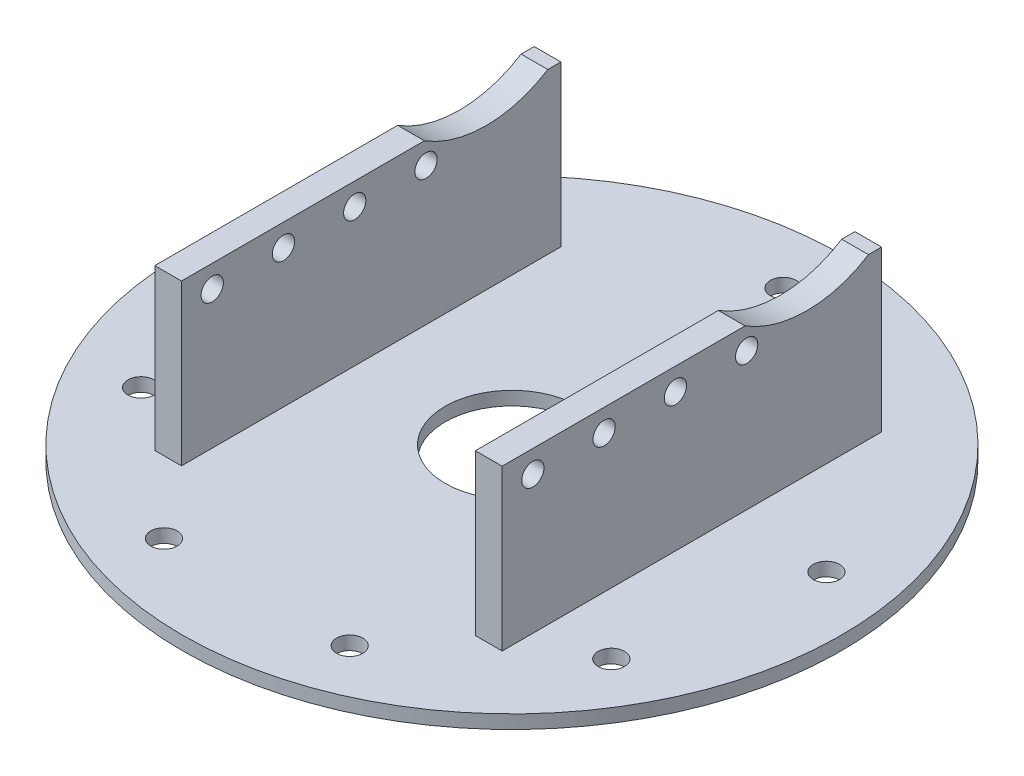
ISO-10303-21;
HEADER;
FILE_DESCRIPTION(('STEP AP214'),'2;1');
FILE_NAME('part.step','',(''),(''),'','','');
FILE_SCHEMA(('AUTOMOTIVE_DESIGN { 1 0 10303 214 1 1 1 1 }'));
ENDSEC;
DATA;
#1=APPLICATION_CONTEXT('core data for automotive mechanical design processes');
#2=APPLICATION_PROTOCOL_DEFINITION('international standard','automotive_design',2000,#1);
#3=PRODUCT_CONTEXT('',#1,'mechanical');
#4=PRODUCT('Part','Part','',(#3));
#5=PRODUCT_RELATED_PRODUCT_CATEGORY('part','',(#4));
#6=PRODUCT_DEFINITION_FORMATION('','',#4);
#7=PRODUCT_DEFINITION_CONTEXT('part definition',#1,'design');
#8=PRODUCT_DEFINITION('design','',#6,#7);
#9=PRODUCT_DEFINITION_SHAPE('','',#8);
#10=(LENGTH_UNIT() NAMED_UNIT(*) SI_UNIT(.MILLI.,.METRE.));
#11=(NAMED_UNIT(*) PLANE_ANGLE_UNIT() SI_UNIT($,.RADIAN.));
#12=(NAMED_UNIT(*) SI_UNIT($,.STERADIAN.) SOLID_ANGLE_UNIT());
#13=UNCERTAINTY_MEASURE_WITH_UNIT(LENGTH_MEASURE(1.E-05),#10,'distance_accuracy_value','');
#14=(GEOMETRIC_REPRESENTATION_CONTEXT(3) GLOBAL_UNCERTAINTY_ASSIGNED_CONTEXT((#13)) GLOBAL_UNIT_ASSIGNED_CONTEXT((#10,
#11,#12)) REPRESENTATION_CONTEXT('',''));
#15=CARTESIAN_POINT('',(0.,0.,0.));
#16=DIRECTION('',(0.,0.,1.));
#17=DIRECTION('',(1.,0.,0.));
#18=AXIS2_PLACEMENT_3D('',#15,#16,#17);
#19=CARTESIAN_POINT('',(26.1339066940855,19.4999999999999,-21.9999999999999));
#20=DIRECTION('',(0.,1.,0.));
#21=DIRECTION('',(0.,0.,1.));
#22=AXIS2_PLACEMENT_3D('',#19,#20,#21);
#23=PLANE('',#22);
#24=DIRECTION('',(-1.,0.,0.));
#25=VECTOR('',#24,1.);
#26=CARTESIAN_POINT('',(56.2695526217004,19.4999999999999,-20.5282032302754));
#27=LINE('',#26,#25);
#28=CARTESIAN_POINT('',(-16.4999999999999,19.4999999999999,-20.5282032302754));
#29=VERTEX_POINT('',#28);
#30=CARTESIAN_POINT('',(-19.4999999999999,19.4999999999999,-20.5282032302754));
#31=VERTEX_POINT('',#30);
#32=EDGE_CURVE('E119',#29,#31,#27,.T.);
#33=ORIENTED_EDGE('',*,*,#32,.F.);
#34=DIRECTION('',(0.,0.,1.));
#35=VECTOR('',#34,1.);
#36=CARTESIAN_POINT('',(-16.4999999999999,19.4999999999999,-21.9999999999999));
#37=LINE('',#36,#35);
#38=CARTESIAN_POINT('',(-16.4999999999999,19.4999999999999,-21.9999999999999));
#39=VERTEX_POINT('',#38);
#40=EDGE_CURVE('E151',#39,#29,#37,.T.);
#41=ORIENTED_EDGE('',*,*,#40,.F.);
#42=DIRECTION('',(-1.,0.,0.));
#43=VECTOR('',#42,1.);
#44=CARTESIAN_POINT('',(26.1339066940855,19.4999999999999,-21.9999999999999));
#45=LINE('',#44,#43);
#46=CARTESIAN_POINT('',(-19.4999999999999,19.4999999999999,-21.9999999999999));
#47=VERTEX_POINT('',#46);
#48=EDGE_CURVE('E142',#39,#47,#45,.T.);
#49=ORIENTED_EDGE('',*,*,#48,.T.);
#50=DIRECTION('',(0.,0.,-1.));
#51=VECTOR('',#50,1.);
#52=CARTESIAN_POINT('',(-19.4999999999999,19.4999999999999,-21.9999999999999));
#53=LINE('',#52,#51);
#54=EDGE_CURVE('E133',#31,#47,#53,.T.);
#55=ORIENTED_EDGE('',*,*,#54,.F.);
#56=EDGE_LOOP('',(#33,#41,#49,#55));
#57=FACE_BOUND('',#56,.T.);
#58=ADVANCED_FACE('F33',(#57),#23,.T.);
#59=CARTESIAN_POINT('',(-26.1339066940853,19.4999999999999,20.5999999999999));
#60=DIRECTION('',(0.,1.,0.));
#61=DIRECTION('',(0.,0.,1.));
#62=AXIS2_PLACEMENT_3D('',#59,#60,#61);
#63=PLANE('',#62);
#64=DIRECTION('',(-1.,0.,0.));
#65=VECTOR('',#64,1.);
#66=CARTESIAN_POINT('',(56.2695526217004,19.4999999999999,-20.5282032302754));
#67=LINE('',#66,#65);
#68=CARTESIAN_POINT('',(19.4999999999999,19.4999999999999,-20.5282032302754));
#69=VERTEX_POINT('',#68);
#70=CARTESIAN_POINT('',(16.5000000000001,19.4999999999999,-20.5282032302754));
#71=VERTEX_POINT('',#70);
#72=EDGE_CURVE('E11',#69,#71,#67,.T.);
#73=ORIENTED_EDGE('',*,*,#72,.F.);
#74=DIRECTION('',(0.,0.,1.));
#75=VECTOR('',#74,1.);
#76=CARTESIAN_POINT('',(19.4999999999999,19.4999999999999,20.5999999999999));
#77=LINE('',#76,#75);
#78=CARTESIAN_POINT('',(19.4999999999999,19.4999999999999,-21.9999999999999));
#79=VERTEX_POINT('',#78);
#80=EDGE_CURVE('E262',#79,#69,#77,.T.);
#81=ORIENTED_EDGE('',*,*,#80,.F.);
#82=DIRECTION('',(1.,0.,0.));
#83=VECTOR('',#82,1.);
#84=CARTESIAN_POINT('',(-26.1339066940853,19.4999999999999,-21.9999999999999));
#85=LINE('',#84,#83);
#86=CARTESIAN_POINT('',(16.5000000000001,19.4999999999999,-21.9999999999999));
#87=VERTEX_POINT('',#86);
#88=EDGE_CURVE('E269',#87,#79,#85,.T.);
#89=ORIENTED_EDGE('',*,*,#88,.F.);
#90=DIRECTION('',(0.,0.,-1.));
#91=VECTOR('',#90,1.);
#92=CARTESIAN_POINT('',(16.5000000000001,19.4999999999999,20.5999999999999));
#93=LINE('',#92,#91);
#94=EDGE_CURVE('E147',#71,#87,#93,.T.);
#95=ORIENTED_EDGE('',*,*,#94,.F.);
#96=EDGE_LOOP('',(#73,#81,#89,#95));
#97=FACE_BOUND('',#96,.T.);
#98=ADVANCED_FACE('F278',(#97),#63,.T.);
#99=CARTESIAN_POINT('',(0.,1.524,0.));
#100=DIRECTION('',(0.,1.,0.));
#101=DIRECTION('',(0.,0.,1.));
#102=AXIS2_PLACEMENT_3D('',#99,#100,#101);
#103=PLANE('',#102);
#104=CARTESIAN_POINT('',(0.,1.524,-30.48));
#105=DIRECTION('',(0.,1.,0.));
#106=DIRECTION('',(0.,0.,1.));
#107=AXIS2_PLACEMENT_3D('',#104,#105,#106);
#108=CIRCLE('',#107,1.47828000000001);
#109=CARTESIAN_POINT('',(0.,1.524,-29.00172));
#110=VERTEX_POINT('',#109);
#111=EDGE_CURVE('E192',#110,#110,#108,.T.);
#112=ORIENTED_EDGE('',*,*,#111,.F.);
#113=EDGE_LOOP('',(#112));
#114=FACE_BOUND('',#113,.T.);
#115=CARTESIAN_POINT('',(30.016940311812,1.524,-5.29279645528849));
#116=DIRECTION('',(0.,1.,0.));
#117=DIRECTION('',(0.,0.,1.));
#118=AXIS2_PLACEMENT_3D('',#115,#116,#117);
#119=CIRCLE('',#118,1.47828000000001);
#120=CARTESIAN_POINT('',(30.016940311812,1.524,-3.81451645528848));
#121=VERTEX_POINT('',#120);
#122=EDGE_CURVE('E198',#121,#121,#119,.T.);
#123=ORIENTED_EDGE('',*,*,#122,.F.);
#124=EDGE_LOOP('',(#123));
#125=FACE_BOUND('',#124,.T.);
#126=CARTESIAN_POINT('',(26.3964543073499,1.524,15.2399999999997));
#127=DIRECTION('',(0.,1.,0.));
#128=DIRECTION('',(0.,0.,1.));
#129=AXIS2_PLACEMENT_3D('',#126,#127,#128);
#130=CIRCLE('',#129,1.47828000000001);
#131=CARTESIAN_POINT('',(26.3964543073499,1.524,16.7182799999997));
#132=VERTEX_POINT('',#131);
#133=EDGE_CURVE('E204',#132,#132,#130,.T.);
#134=ORIENTED_EDGE('',*,*,#133,.F.);
#135=EDGE_LOOP('',(#134));
#136=FACE_BOUND('',#135,.T.);
#137=CARTESIAN_POINT('',(10.4247739685667,1.524,28.6418310815544));
#138=DIRECTION('',(0.,1.,0.));
#139=DIRECTION('',(0.,0.,1.));
#140=AXIS2_PLACEMENT_3D('',#137,#138,#139);
#141=CIRCLE('',#140,1.47828000000001);
#142=CARTESIAN_POINT('',(10.4247739685667,1.524,30.1201110815544));
#143=VERTEX_POINT('',#142);
#144=EDGE_CURVE('E210',#143,#143,#141,.T.);
#145=ORIENTED_EDGE('',*,*,#144,.F.);
#146=EDGE_LOOP('',(#145));
#147=FACE_BOUND('',#146,.T.);
#148=CARTESIAN_POINT('',(-10.4247739685661,1.524,28.6418310815546));
#149=DIRECTION('',(0.,1.,0.));
#150=DIRECTION('',(0.,0.,1.));
#151=AXIS2_PLACEMENT_3D('',#148,#149,#150);
#152=CIRCLE('',#151,1.47828000000001);
#153=CARTESIAN_POINT('',(-10.4247739685661,1.524,30.1201110815546));
#154=VERTEX_POINT('',#153);
#155=EDGE_CURVE('E216',#154,#154,#152,.T.);
#156=ORIENTED_EDGE('',*,*,#155,.F.);
#157=EDGE_LOOP('',(#156));
#158=FACE_BOUND('',#157,.T.);
#159=CARTESIAN_POINT('',(-26.3964543073496,1.524,15.2400000000002));
#160=DIRECTION('',(0.,1.,0.));
#161=DIRECTION('',(0.,0.,1.));
#162=AXIS2_PLACEMENT_3D('',#159,#160,#161);
#163=CIRCLE('',#162,1.47828000000001);
#164=CARTESIAN_POINT('',(-26.3964543073496,1.524,16.7182800000002));
#165=VERTEX_POINT('',#164);
#166=EDGE_CURVE('E222',#165,#165,#163,.T.);
#167=ORIENTED_EDGE('',*,*,#166,.F.);
#168=EDGE_LOOP('',(#167));
#169=FACE_BOUND('',#168,.T.);
#170=CARTESIAN_POINT('',(-30.0169403118121,1.524,-5.29279645528783));
#171=DIRECTION('',(0.,1.,0.));
#172=DIRECTION('',(0.,0.,1.));
#173=AXIS2_PLACEMENT_3D('',#170,#171,#172);
#174=CIRCLE('',#173,1.47828000000001);
#175=CARTESIAN_POINT('',(-30.0169403118121,1.524,-3.81451645528782));
#176=VERTEX_POINT('',#175);
#177=EDGE_CURVE('E228',#176,#176,#174,.T.);
#178=ORIENTED_EDGE('',*,*,#177,.F.);
#179=EDGE_LOOP('',(#178));
#180=FACE_BOUND('',#179,.T.);
#181=CARTESIAN_POINT('',(0.,1.524,0.));
#182=DIRECTION('',(0.,1.,0.));
#183=DIRECTION('',(0.,0.,1.));
#184=AXIS2_PLACEMENT_3D('',#181,#182,#183);
#185=CIRCLE('',#184,37.);
#186=CARTESIAN_POINT('',(0.,1.524,37.));
#187=VERTEX_POINT('',#186);
#188=EDGE_CURVE('E244',#187,#187,#185,.T.);
#189=ORIENTED_EDGE('',*,*,#188,.T.);
#190=EDGE_LOOP('',(#189));
#191=FACE_BOUND('',#190,.T.);
#192=CARTESIAN_POINT('',(0.,1.524,0.));
#193=DIRECTION('',(0.,1.,0.));
#194=DIRECTION('',(0.,0.,1.));
#195=AXIS2_PLACEMENT_3D('',#192,#193,#194);
#196=CIRCLE('',#195,7.49999999999999);
#197=CARTESIAN_POINT('',(0.,1.524,7.49999999999999));
#198=VERTEX_POINT('',#197);
#199=EDGE_CURVE('E191',#198,#198,#196,.T.);
#200=ORIENTED_EDGE('',*,*,#199,.F.);
#201=EDGE_LOOP('',(#200));
#202=FACE_BOUND('',#201,.T.);
#203=DIRECTION('',(0.,0.,-1.));
#204=VECTOR('',#203,1.);
#205=CARTESIAN_POINT('',(19.4999999999999,1.524,20.5999999999999));
#206=LINE('',#205,#204);
#207=CARTESIAN_POINT('',(19.4999999999999,1.524,20.5999999999999));
#208=VERTEX_POINT('',#207);
#209=CARTESIAN_POINT('',(19.4999999999999,1.524,-21.9999999999999));
#210=VERTEX_POINT('',#209);
#211=EDGE_CURVE('E167',#208,#210,#206,.T.);
#212=ORIENTED_EDGE('',*,*,#211,.F.);
#213=DIRECTION('',(1.,0.,0.));
#214=VECTOR('',#213,1.);
#215=CARTESIAN_POINT('',(17.9999999999999,1.524,20.5999999999999));
#216=LINE('',#215,#214);
#217=CARTESIAN_POINT('',(16.5000000000001,1.524,20.5999999999999));
#218=VERTEX_POINT('',#217);
#219=EDGE_CURVE('E237',#218,#208,#216,.T.);
#220=ORIENTED_EDGE('',*,*,#219,.F.);
#221=DIRECTION('',(0.,0.,1.));
#222=VECTOR('',#221,1.);
#223=CARTESIAN_POINT('',(16.5000000000001,1.524,-24.4753618826042));
#224=LINE('',#223,#222);
#225=CARTESIAN_POINT('',(16.5000000000001,1.524,-21.9999999999999));
#226=VERTEX_POINT('',#225);
#227=EDGE_CURVE('E172',#226,#218,#224,.T.);
#228=ORIENTED_EDGE('',*,*,#227,.F.);
#229=DIRECTION('',(-1.,0.,0.));
#230=VECTOR('',#229,1.);
#231=CARTESIAN_POINT('',(14.9999999999999,1.524,-21.9999999999999));
#232=LINE('',#231,#230);
#233=EDGE_CURVE('E234',#210,#226,#232,.T.);
#234=ORIENTED_EDGE('',*,*,#233,.F.);
#235=EDGE_LOOP('',(#212,#220,#228,#234));
#236=FACE_BOUND('',#235,.T.);
#237=DIRECTION('',(0.,0.,1.));
#238=VECTOR('',#237,1.);
#239=CARTESIAN_POINT('',(-19.4999999999999,1.524,-21.9999999999999));
#240=LINE('',#239,#238);
#241=CARTESIAN_POINT('',(-19.4999999999999,1.524,-21.9999999999999));
#242=VERTEX_POINT('',#241);
#243=CARTESIAN_POINT('',(-19.4999999999999,1.524,20.5999999999999));
#244=VERTEX_POINT('',#243);
#245=EDGE_CURVE('E159',#242,#244,#240,.T.);
#246=ORIENTED_EDGE('',*,*,#245,.F.);
#247=DIRECTION('',(-1.,0.,0.));
#248=VECTOR('',#247,1.);
#249=CARTESIAN_POINT('',(-17.9999999999999,1.524,-21.9999999999999));
#250=LINE('',#249,#248);
#251=CARTESIAN_POINT('',(-16.4999999999999,1.524,-21.9999999999999));
#252=VERTEX_POINT('',#251);
#253=EDGE_CURVE('E239',#252,#242,#250,.T.);
#254=ORIENTED_EDGE('',*,*,#253,.F.);
#255=DIRECTION('',(0.,0.,-1.));
#256=VECTOR('',#255,1.);
#257=CARTESIAN_POINT('',(-16.4999999999999,1.524,-24.4753618826042));
#258=LINE('',#257,#256);
#259=CARTESIAN_POINT('',(-16.4999999999999,1.524,20.5999999999999));
#260=VERTEX_POINT('',#259);
#261=EDGE_CURVE('E174',#260,#252,#258,.T.);
#262=ORIENTED_EDGE('',*,*,#261,.F.);
#263=DIRECTION('',(1.,0.,0.));
#264=VECTOR('',#263,1.);
#265=CARTESIAN_POINT('',(-14.9999999999999,1.524,20.5999999999999));
#266=LINE('',#265,#264);
#267=EDGE_CURVE('E241',#244,#260,#266,.T.);
#268=ORIENTED_EDGE('',*,*,#267,.F.);
#269=EDGE_LOOP('',(#246,#254,#262,#268));
#270=FACE_BOUND('',#269,.T.);
#271=ADVANCED_FACE('F298',(#114,#125,#136,#147,#158,#169,#180,#191,#202,#236,#270),#103,.T.);
#272=CARTESIAN_POINT('',(0.,0.,0.));
#273=DIRECTION('',(0.,1.,0.));
#274=DIRECTION('',(0.,0.,1.));
#275=AXIS2_PLACEMENT_3D('',#272,#273,#274);
#276=CYLINDRICAL_SURFACE('',#275,37.);
#277=CARTESIAN_POINT('',(0.,0.,0.));
#278=DIRECTION('',(0.,1.,0.));
#279=DIRECTION('',(0.,0.,1.));
#280=AXIS2_PLACEMENT_3D('',#277,#278,#279);
#281=CIRCLE('',#280,37.);
#282=CARTESIAN_POINT('',(0.,0.,37.));
#283=VERTEX_POINT('',#282);
#284=EDGE_CURVE('E247',#283,#283,#281,.T.);
#285=ORIENTED_EDGE('',*,*,#284,.T.);
#286=EDGE_LOOP('',(#285));
#287=FACE_BOUND('',#286,.T.);
#288=ORIENTED_EDGE('',*,*,#188,.F.);
#289=EDGE_LOOP('',(#288));
#290=FACE_BOUND('',#289,.T.);
#291=ADVANCED_FACE('F35',(#287,#290),#276,.T.);
#292=CARTESIAN_POINT('',(37.,0.,0.));
#293=DIRECTION('',(0.,-1.,0.));
#294=DIRECTION('',(0.,0.,-1.));
#295=AXIS2_PLACEMENT_3D('',#292,#293,#294);
#296=PLANE('',#295);
#297=CARTESIAN_POINT('',(0.,0.,0.));
#298=DIRECTION('',(0.,-1.,0.));
#299=DIRECTION('',(0.,0.,-1.));
#300=AXIS2_PLACEMENT_3D('',#297,#298,#299);
#301=CIRCLE('',#300,7.49999999999999);
#302=CARTESIAN_POINT('',(0.,0.,-7.49999999999999));
#303=VERTEX_POINT('',#302);
#304=EDGE_CURVE('E188',#303,#303,#301,.T.);
#305=ORIENTED_EDGE('',*,*,#304,.F.);
#306=EDGE_LOOP('',(#305));
#307=FACE_BOUND('',#306,.T.);
#308=CARTESIAN_POINT('',(0.,0.,-30.48));
#309=DIRECTION('',(0.,1.,0.));
#310=DIRECTION('',(0.,0.,1.));
#311=AXIS2_PLACEMENT_3D('',#308,#309,#310);
#312=CIRCLE('',#311,1.47828000000001);
#313=CARTESIAN_POINT('',(0.,0.,-29.00172));
#314=VERTEX_POINT('',#313);
#315=EDGE_CURVE('E195',#314,#314,#312,.T.);
#316=ORIENTED_EDGE('',*,*,#315,.T.);
#317=EDGE_LOOP('',(#316));
#318=FACE_BOUND('',#317,.T.);
#319=CARTESIAN_POINT('',(30.016940311812,0.,-5.29279645528849));
#320=DIRECTION('',(0.,1.,0.));
#321=DIRECTION('',(0.,0.,1.));
#322=AXIS2_PLACEMENT_3D('',#319,#320,#321);
#323=CIRCLE('',#322,1.47828000000001);
#324=CARTESIAN_POINT('',(30.016940311812,0.,-3.81451645528848));
#325=VERTEX_POINT('',#324);
#326=EDGE_CURVE('E201',#325,#325,#323,.T.);
#327=ORIENTED_EDGE('',*,*,#326,.T.);
#328=EDGE_LOOP('',(#327));
#329=FACE_BOUND('',#328,.T.);
#330=CARTESIAN_POINT('',(26.3964543073499,0.,15.2399999999997));
#331=DIRECTION('',(0.,1.,0.));
#332=DIRECTION('',(0.,0.,1.));
#333=AXIS2_PLACEMENT_3D('',#330,#331,#332);
#334=CIRCLE('',#333,1.47828000000001);
#335=CARTESIAN_POINT('',(26.3964543073499,0.,16.7182799999997));
#336=VERTEX_POINT('',#335);
#337=EDGE_CURVE('E207',#336,#336,#334,.T.);
#338=ORIENTED_EDGE('',*,*,#337,.T.);
#339=EDGE_LOOP('',(#338));
#340=FACE_BOUND('',#339,.T.);
#341=CARTESIAN_POINT('',(10.4247739685667,0.,28.6418310815544));
#342=DIRECTION('',(0.,1.,0.));
#343=DIRECTION('',(0.,0.,1.));
#344=AXIS2_PLACEMENT_3D('',#341,#342,#343);
#345=CIRCLE('',#344,1.47828000000001);
#346=CARTESIAN_POINT('',(10.4247739685667,0.,30.1201110815544));
#347=VERTEX_POINT('',#346);
#348=EDGE_CURVE('E213',#347,#347,#345,.T.);
#349=ORIENTED_EDGE('',*,*,#348,.T.);
#350=EDGE_LOOP('',(#349));
#351=FACE_BOUND('',#350,.T.);
#352=CARTESIAN_POINT('',(-10.4247739685661,0.,28.6418310815546));
#353=DIRECTION('',(0.,1.,0.));
#354=DIRECTION('',(0.,0.,1.));
#355=AXIS2_PLACEMENT_3D('',#352,#353,#354);
#356=CIRCLE('',#355,1.47828000000001);
#357=CARTESIAN_POINT('',(-10.4247739685661,0.,30.1201110815546));
#358=VERTEX_POINT('',#357);
#359=EDGE_CURVE('E219',#358,#358,#356,.T.);
#360=ORIENTED_EDGE('',*,*,#359,.T.);
#361=EDGE_LOOP('',(#360));
#362=FACE_BOUND('',#361,.T.);
#363=CARTESIAN_POINT('',(-26.3964543073496,0.,15.2400000000002));
#364=DIRECTION('',(0.,1.,0.));
#365=DIRECTION('',(0.,0.,1.));
#366=AXIS2_PLACEMENT_3D('',#363,#364,#365);
#367=CIRCLE('',#366,1.47828000000001);
#368=CARTESIAN_POINT('',(-26.3964543073496,0.,16.7182800000002));
#369=VERTEX_POINT('',#368);
#370=EDGE_CURVE('E225',#369,#369,#367,.T.);
#371=ORIENTED_EDGE('',*,*,#370,.T.);
#372=EDGE_LOOP('',(#371));
#373=FACE_BOUND('',#372,.T.);
#374=CARTESIAN_POINT('',(-30.0169403118121,0.,-5.29279645528783));
#375=DIRECTION('',(0.,1.,0.));
#376=DIRECTION('',(0.,0.,1.));
#377=AXIS2_PLACEMENT_3D('',#374,#375,#376);
#378=CIRCLE('',#377,1.47828000000001);
#379=CARTESIAN_POINT('',(-30.0169403118121,0.,-3.81451645528782));
#380=VERTEX_POINT('',#379);
#381=EDGE_CURVE('E231',#380,#380,#378,.T.);
#382=ORIENTED_EDGE('',*,*,#381,.T.);
#383=EDGE_LOOP('',(#382));
#384=FACE_BOUND('',#383,.T.);
#385=ORIENTED_EDGE('',*,*,#284,.F.);
#386=EDGE_LOOP('',(#385));
#387=FACE_BOUND('',#386,.T.);
#388=ADVANCED_FACE('F302',(#307,#318,#329,#340,#351,#362,#373,#384,#387),#296,.T.);
#389=CARTESIAN_POINT('',(-17.9999999999999,17.7999999999999,-21.9999999999999));
#390=DIRECTION('',(0.,0.,1.));
#391=DIRECTION('',(1.,0.,0.));
#392=AXIS2_PLACEMENT_3D('',#389,#390,#391);
#393=PLANE('',#392);
#394=DIRECTION('',(0.,-1.,0.));
#395=VECTOR('',#394,1.);
#396=CARTESIAN_POINT('',(-19.4999999999999,17.7999999999999,-21.9999999999999));
#397=LINE('',#396,#395);
#398=EDGE_CURVE('E157',#47,#242,#397,.T.);
#399=ORIENTED_EDGE('',*,*,#398,.F.);
#400=ORIENTED_EDGE('',*,*,#48,.F.);
#401=DIRECTION('',(0.,-1.,0.));
#402=VECTOR('',#401,1.);
#403=CARTESIAN_POINT('',(-16.4999999999999,17.7999999999999,-21.9999999999999));
#404=LINE('',#403,#402);
#405=EDGE_CURVE('E185',#39,#252,#404,.T.);
#406=ORIENTED_EDGE('',*,*,#405,.T.);
#407=ORIENTED_EDGE('',*,*,#253,.T.);
#408=EDGE_LOOP('',(#399,#400,#406,#407));
#409=FACE_BOUND('',#408,.T.);
#410=ADVANCED_FACE('F300',(#409),#393,.F.);
#411=CARTESIAN_POINT('',(-14.9999999999999,17.7999999999999,20.5999999999999));
#412=DIRECTION('',(0.,0.,-1.));
#413=DIRECTION('',(-1.,0.,0.));
#414=AXIS2_PLACEMENT_3D('',#411,#412,#413);
#415=PLANE('',#414);
#416=ORIENTED_EDGE('',*,*,#267,.T.);
#417=DIRECTION('',(0.,1.,0.));
#418=VECTOR('',#417,1.);
#419=CARTESIAN_POINT('',(-16.4999999999999,17.7999999999999,20.5999999999999));
#420=LINE('',#419,#418);
#421=CARTESIAN_POINT('',(-16.4999999999999,19.4999999999999,20.5999999999999));
#422=VERTEX_POINT('',#421);
#423=EDGE_CURVE('E182',#260,#422,#420,.T.);
#424=ORIENTED_EDGE('',*,*,#423,.T.);
#425=DIRECTION('',(-1.,0.,0.));
#426=VECTOR('',#425,1.);
#427=CARTESIAN_POINT('',(26.1339066940855,19.4999999999999,20.5999999999999));
#428=LINE('',#427,#426);
#429=CARTESIAN_POINT('',(-19.4999999999999,19.4999999999999,20.5999999999999));
#430=VERTEX_POINT('',#429);
#431=EDGE_CURVE('E145',#422,#430,#428,.T.);
#432=ORIENTED_EDGE('',*,*,#431,.T.);
#433=DIRECTION('',(0.,1.,0.));
#434=VECTOR('',#433,1.);
#435=CARTESIAN_POINT('',(-19.4999999999999,17.7999999999999,20.5999999999999));
#436=LINE('',#435,#434);
#437=EDGE_CURVE('E162',#244,#430,#436,.T.);
#438=ORIENTED_EDGE('',*,*,#437,.F.);
#439=EDGE_LOOP('',(#416,#424,#432,#438));
#440=FACE_BOUND('',#439,.T.);
#441=ADVANCED_FACE('F293',(#440),#415,.F.);
#442=CARTESIAN_POINT('',(14.9999999999999,17.7999999999999,-21.9999999999999));
#443=DIRECTION('',(0.,0.,1.));
#444=DIRECTION('',(1.,0.,0.));
#445=AXIS2_PLACEMENT_3D('',#442,#443,#444);
#446=PLANE('',#445);
#447=ORIENTED_EDGE('',*,*,#233,.T.);
#448=DIRECTION('',(0.,1.,0.));
#449=VECTOR('',#448,1.);
#450=CARTESIAN_POINT('',(16.5000000000001,17.7999999999999,-21.9999999999999));
#451=LINE('',#450,#449);
#452=EDGE_CURVE('E179',#226,#87,#451,.T.);
#453=ORIENTED_EDGE('',*,*,#452,.T.);
#454=ORIENTED_EDGE('',*,*,#88,.T.);
#455=DIRECTION('',(0.,1.,0.));
#456=VECTOR('',#455,1.);
#457=CARTESIAN_POINT('',(19.4999999999999,17.7999999999999,-21.9999999999999));
#458=LINE('',#457,#456);
#459=EDGE_CURVE('E170',#210,#79,#458,.T.);
#460=ORIENTED_EDGE('',*,*,#459,.F.);
#461=EDGE_LOOP('',(#447,#453,#454,#460));
#462=FACE_BOUND('',#461,.T.);
#463=ADVANCED_FACE('F275',(#462),#446,.F.);
#464=CARTESIAN_POINT('',(17.9999999999999,17.7999999999999,20.5999999999999));
#465=DIRECTION('',(0.,0.,-1.));
#466=DIRECTION('',(-1.,0.,0.));
#467=AXIS2_PLACEMENT_3D('',#464,#465,#466);
#468=PLANE('',#467);
#469=DIRECTION('',(0.,-1.,0.));
#470=VECTOR('',#469,1.);
#471=CARTESIAN_POINT('',(19.4999999999999,17.7999999999999,20.5999999999999));
#472=LINE('',#471,#470);
#473=CARTESIAN_POINT('',(19.4999999999999,19.4999999999999,20.5999999999999));
#474=VERTEX_POINT('',#473);
#475=EDGE_CURVE('E164',#474,#208,#472,.T.);
#476=ORIENTED_EDGE('',*,*,#475,.F.);
#477=DIRECTION('',(1.,0.,0.));
#478=VECTOR('',#477,1.);
#479=CARTESIAN_POINT('',(-26.1339066940853,19.4999999999999,20.5999999999999));
#480=LINE('',#479,#478);
#481=CARTESIAN_POINT('',(16.5000000000001,19.4999999999999,20.5999999999999));
#482=VERTEX_POINT('',#481);
#483=EDGE_CURVE('E267',#482,#474,#480,.T.);
#484=ORIENTED_EDGE('',*,*,#483,.F.);
#485=DIRECTION('',(0.,-1.,0.));
#486=VECTOR('',#485,1.);
#487=CARTESIAN_POINT('',(16.5000000000001,17.7999999999999,20.5999999999999));
#488=LINE('',#487,#486);
#489=EDGE_CURVE('E176',#482,#218,#488,.T.);
#490=ORIENTED_EDGE('',*,*,#489,.T.);
#491=ORIENTED_EDGE('',*,*,#219,.T.);
#492=EDGE_LOOP('',(#476,#484,#490,#491));
#493=FACE_BOUND('',#492,.T.);
#494=ADVANCED_FACE('F370',(#493),#468,.F.);
#495=CARTESIAN_POINT('',(-30.0169403118121,1.524,-5.29279645528783));
#496=DIRECTION('',(0.,1.,0.));
#497=DIRECTION('',(0.,0.,1.));
#498=AXIS2_PLACEMENT_3D('',#495,#496,#497);
#499=CYLINDRICAL_SURFACE('',#498,1.47828000000001);
#500=ORIENTED_EDGE('',*,*,#381,.F.);
#501=EDGE_LOOP('',(#500));
#502=FACE_BOUND('',#501,.T.);
#503=ORIENTED_EDGE('',*,*,#177,.T.);
#504=EDGE_LOOP('',(#503));
#505=FACE_BOUND('',#504,.T.);
#506=ADVANCED_FACE('F366',(#502,#505),#499,.F.);
#507=CARTESIAN_POINT('',(-26.3964543073496,1.524,15.2400000000002));
#508=DIRECTION('',(0.,1.,0.));
#509=DIRECTION('',(0.,0.,1.));
#510=AXIS2_PLACEMENT_3D('',#507,#508,#509);
#511=CYLINDRICAL_SURFACE('',#510,1.47828000000001);
#512=ORIENTED_EDGE('',*,*,#370,.F.);
#513=EDGE_LOOP('',(#512));
#514=FACE_BOUND('',#513,.T.);
#515=ORIENTED_EDGE('',*,*,#166,.T.);
#516=EDGE_LOOP('',(#515));
#517=FACE_BOUND('',#516,.T.);
#518=ADVANCED_FACE('F362',(#514,#517),#511,.F.);
#519=CARTESIAN_POINT('',(-10.4247739685661,1.524,28.6418310815546));
#520=DIRECTION('',(0.,1.,0.));
#521=DIRECTION('',(0.,0.,1.));
#522=AXIS2_PLACEMENT_3D('',#519,#520,#521);
#523=CYLINDRICAL_SURFACE('',#522,1.47828000000001);
#524=ORIENTED_EDGE('',*,*,#359,.F.);
#525=EDGE_LOOP('',(#524));
#526=FACE_BOUND('',#525,.T.);
#527=ORIENTED_EDGE('',*,*,#155,.T.);
#528=EDGE_LOOP('',(#527));
#529=FACE_BOUND('',#528,.T.);
#530=ADVANCED_FACE('F358',(#526,#529),#523,.F.);
#531=CARTESIAN_POINT('',(10.4247739685667,1.524,28.6418310815544));
#532=DIRECTION('',(0.,1.,0.));
#533=DIRECTION('',(0.,0.,1.));
#534=AXIS2_PLACEMENT_3D('',#531,#532,#533);
#535=CYLINDRICAL_SURFACE('',#534,1.47828000000001);
#536=ORIENTED_EDGE('',*,*,#348,.F.);
#537=EDGE_LOOP('',(#536));
#538=FACE_BOUND('',#537,.T.);
#539=ORIENTED_EDGE('',*,*,#144,.T.);
#540=EDGE_LOOP('',(#539));
#541=FACE_BOUND('',#540,.T.);
#542=ADVANCED_FACE('F354',(#538,#541),#535,.F.);
#543=CARTESIAN_POINT('',(26.3964543073499,1.524,15.2399999999997));
#544=DIRECTION('',(0.,1.,0.));
#545=DIRECTION('',(0.,0.,1.));
#546=AXIS2_PLACEMENT_3D('',#543,#544,#545);
#547=CYLINDRICAL_SURFACE('',#546,1.47828000000001);
#548=ORIENTED_EDGE('',*,*,#337,.F.);
#549=EDGE_LOOP('',(#548));
#550=FACE_BOUND('',#549,.T.);
#551=ORIENTED_EDGE('',*,*,#133,.T.);
#552=EDGE_LOOP('',(#551));
#553=FACE_BOUND('',#552,.T.);
#554=ADVANCED_FACE('F350',(#550,#553),#547,.F.);
#555=CARTESIAN_POINT('',(30.016940311812,1.524,-5.29279645528849));
#556=DIRECTION('',(0.,1.,0.));
#557=DIRECTION('',(0.,0.,1.));
#558=AXIS2_PLACEMENT_3D('',#555,#556,#557);
#559=CYLINDRICAL_SURFACE('',#558,1.47828000000001);
#560=ORIENTED_EDGE('',*,*,#326,.F.);
#561=EDGE_LOOP('',(#560));
#562=FACE_BOUND('',#561,.T.);
#563=ORIENTED_EDGE('',*,*,#122,.T.);
#564=EDGE_LOOP('',(#563));
#565=FACE_BOUND('',#564,.T.);
#566=ADVANCED_FACE('F346',(#562,#565),#559,.F.);
#567=CARTESIAN_POINT('',(0.,1.524,-30.48));
#568=DIRECTION('',(0.,1.,0.));
#569=DIRECTION('',(0.,0.,1.));
#570=AXIS2_PLACEMENT_3D('',#567,#568,#569);
#571=CYLINDRICAL_SURFACE('',#570,1.47828000000001);
#572=ORIENTED_EDGE('',*,*,#315,.F.);
#573=EDGE_LOOP('',(#572));
#574=FACE_BOUND('',#573,.T.);
#575=ORIENTED_EDGE('',*,*,#111,.T.);
#576=EDGE_LOOP('',(#575));
#577=FACE_BOUND('',#576,.T.);
#578=ADVANCED_FACE('F342',(#574,#577),#571,.F.);
#579=CARTESIAN_POINT('',(0.,0.,0.));
#580=DIRECTION('',(0.,-1.,0.));
#581=DIRECTION('',(0.,0.,-1.));
#582=AXIS2_PLACEMENT_3D('',#579,#580,#581);
#583=CYLINDRICAL_SURFACE('',#582,7.49999999999999);
#584=ORIENTED_EDGE('',*,*,#199,.T.);
#585=EDGE_LOOP('',(#584));
#586=FACE_BOUND('',#585,.T.);
#587=ORIENTED_EDGE('',*,*,#304,.T.);
#588=EDGE_LOOP('',(#587));
#589=FACE_BOUND('',#588,.T.);
#590=ADVANCED_FACE('F335',(#586,#589),#583,.F.);
#591=CARTESIAN_POINT('',(16.5000000000001,-57.2982626501741,-24.4753618826042));
#592=DIRECTION('',(1.,0.,0.));
#593=DIRECTION('',(0.,0.,-1.));
#594=AXIS2_PLACEMENT_3D('',#591,#592,#593);
#595=PLANE('',#594);
#596=CARTESIAN_POINT('',(16.5000000000001,16.9999999999999,-6.85000000000012));
#597=DIRECTION('',(1.,0.,0.));
#598=DIRECTION('',(0.,0.,-1.));
#599=AXIS2_PLACEMENT_3D('',#596,#597,#598);
#600=CIRCLE('',#599,1.25);
#601=CARTESIAN_POINT('',(16.5000000000001,16.9999999999999,-8.10000000000012));
#602=VERTEX_POINT('',#601);
#603=EDGE_CURVE('E625',#602,#602,#600,.T.);
#604=ORIENTED_EDGE('',*,*,#603,.T.);
#605=EDGE_LOOP('',(#604));
#606=FACE_BOUND('',#605,.T.);
#607=CARTESIAN_POINT('',(16.5000000000001,16.9999999999999,1.14999999999988));
#608=DIRECTION('',(1.,0.,0.));
#609=DIRECTION('',(0.,0.,-1.));
#610=AXIS2_PLACEMENT_3D('',#607,#608,#609);
#611=CIRCLE('',#610,1.25);
#612=CARTESIAN_POINT('',(16.5000000000001,16.9999999999999,-0.100000000000124));
#613=VERTEX_POINT('',#612);
#614=EDGE_CURVE('E641',#613,#613,#611,.T.);
#615=ORIENTED_EDGE('',*,*,#614,.T.);
#616=EDGE_LOOP('',(#615));
#617=FACE_BOUND('',#616,.T.);
#618=CARTESIAN_POINT('',(16.5000000000001,16.9999999999999,9.14999999999988));
#619=DIRECTION('',(1.,0.,0.));
#620=DIRECTION('',(0.,0.,-1.));
#621=AXIS2_PLACEMENT_3D('',#618,#619,#620);
#622=CIRCLE('',#621,1.25);
#623=CARTESIAN_POINT('',(16.5000000000001,16.9999999999999,7.89999999999988));
#624=VERTEX_POINT('',#623);
#625=EDGE_CURVE('E653',#624,#624,#622,.T.);
#626=ORIENTED_EDGE('',*,*,#625,.T.);
#627=EDGE_LOOP('',(#626));
#628=FACE_BOUND('',#627,.T.);
#629=CARTESIAN_POINT('',(16.5000000000001,16.9999999999999,17.1499999999999));
#630=DIRECTION('',(1.,0.,0.));
#631=DIRECTION('',(0.,0.,-1.));
#632=AXIS2_PLACEMENT_3D('',#629,#630,#631);
#633=CIRCLE('',#632,1.25);
#634=CARTESIAN_POINT('',(16.5000000000001,16.9999999999999,15.8999999999999));
#635=VERTEX_POINT('',#634);
#636=EDGE_CURVE('E138',#635,#635,#633,.T.);
#637=ORIENTED_EDGE('',*,*,#636,.T.);
#638=EDGE_LOOP('',(#637));
#639=FACE_BOUND('',#638,.T.);
#640=CARTESIAN_POINT('',(16.5000000000001,19.4999999999999,-6.67179676972438));
#641=VERTEX_POINT('',#640);
#642=EDGE_CURVE('E143',#482,#641,#93,.T.);
#643=ORIENTED_EDGE('',*,*,#642,.T.);
#644=CARTESIAN_POINT('',(16.5000000000001,30.4999999999999,-13.5999999999999));
#645=DIRECTION('',(1.,0.,0.));
#646=DIRECTION('',(0.,0.,-1.));
#647=AXIS2_PLACEMENT_3D('',#644,#645,#646);
#648=CIRCLE('',#647,13.);
#649=EDGE_CURVE('E55',#641,#71,#648,.T.);
#650=ORIENTED_EDGE('',*,*,#649,.T.);
#651=ORIENTED_EDGE('',*,*,#94,.T.);
#652=ORIENTED_EDGE('',*,*,#452,.F.);
#653=ORIENTED_EDGE('',*,*,#227,.T.);
#654=ORIENTED_EDGE('',*,*,#489,.F.);
#655=EDGE_LOOP('',(#643,#650,#651,#652,#653,#654));
#656=FACE_BOUND('',#655,.T.);
#657=ADVANCED_FACE('F280',(#606,#617,#628,#639,#656),#595,.F.);
#658=CARTESIAN_POINT('',(-16.4999999999999,-57.2982626501741,-24.4753618826042));
#659=DIRECTION('',(-1.,0.,0.));
#660=DIRECTION('',(0.,0.,1.));
#661=AXIS2_PLACEMENT_3D('',#658,#659,#660);
#662=PLANE('',#661);
#663=CARTESIAN_POINT('',(-16.4999999999999,16.9999999999999,-6.85000000000012));
#664=DIRECTION('',(-1.,0.,0.));
#665=DIRECTION('',(0.,0.,1.));
#666=AXIS2_PLACEMENT_3D('',#663,#664,#665);
#667=CIRCLE('',#666,1.25);
#668=CARTESIAN_POINT('',(-16.4999999999999,16.9999999999999,-5.60000000000012));
#669=VERTEX_POINT('',#668);
#670=EDGE_CURVE('E627',#669,#669,#667,.T.);
#671=ORIENTED_EDGE('',*,*,#670,.T.);
#672=EDGE_LOOP('',(#671));
#673=FACE_BOUND('',#672,.T.);
#674=CARTESIAN_POINT('',(-16.4999999999999,16.9999999999999,1.14999999999988));
#675=DIRECTION('',(-1.,0.,0.));
#676=DIRECTION('',(0.,0.,1.));
#677=AXIS2_PLACEMENT_3D('',#674,#675,#676);
#678=CIRCLE('',#677,1.25);
#679=CARTESIAN_POINT('',(-16.4999999999999,16.9999999999999,2.39999999999988));
#680=VERTEX_POINT('',#679);
#681=EDGE_CURVE('E638',#680,#680,#678,.T.);
#682=ORIENTED_EDGE('',*,*,#681,.T.);
#683=EDGE_LOOP('',(#682));
#684=FACE_BOUND('',#683,.T.);
#685=CARTESIAN_POINT('',(-16.4999999999999,16.9999999999999,9.14999999999988));
#686=DIRECTION('',(-1.,0.,0.));
#687=DIRECTION('',(0.,0.,1.));
#688=AXIS2_PLACEMENT_3D('',#685,#686,#687);
#689=CIRCLE('',#688,1.25);
#690=CARTESIAN_POINT('',(-16.4999999999999,16.9999999999999,10.3999999999999));
#691=VERTEX_POINT('',#690);
#692=EDGE_CURVE('E650',#691,#691,#689,.T.);
#693=ORIENTED_EDGE('',*,*,#692,.T.);
#694=EDGE_LOOP('',(#693));
#695=FACE_BOUND('',#694,.T.);
#696=CARTESIAN_POINT('',(-16.4999999999999,16.9999999999999,17.1499999999999));
#697=DIRECTION('',(-1.,0.,0.));
#698=DIRECTION('',(0.,0.,1.));
#699=AXIS2_PLACEMENT_3D('',#696,#697,#698);
#700=CIRCLE('',#699,1.25);
#701=CARTESIAN_POINT('',(-16.4999999999999,16.9999999999999,18.3999999999999));
#702=VERTEX_POINT('',#701);
#703=EDGE_CURVE('E662',#702,#702,#700,.T.);
#704=ORIENTED_EDGE('',*,*,#703,.T.);
#705=EDGE_LOOP('',(#704));
#706=FACE_BOUND('',#705,.T.);
#707=ORIENTED_EDGE('',*,*,#40,.T.);
#708=CARTESIAN_POINT('',(-16.4999999999999,30.4999999999999,-13.5999999999999));
#709=DIRECTION('',(-1.,0.,0.));
#710=DIRECTION('',(0.,0.,1.));
#711=AXIS2_PLACEMENT_3D('',#708,#709,#710);
#712=CIRCLE('',#711,13.);
#713=CARTESIAN_POINT('',(-16.4999999999999,19.4999999999999,-6.67179676972438));
#714=VERTEX_POINT('',#713);
#715=EDGE_CURVE('E122',#29,#714,#712,.T.);
#716=ORIENTED_EDGE('',*,*,#715,.T.);
#717=EDGE_CURVE('E154',#714,#422,#37,.T.);
#718=ORIENTED_EDGE('',*,*,#717,.T.);
#719=ORIENTED_EDGE('',*,*,#423,.F.);
#720=ORIENTED_EDGE('',*,*,#261,.T.);
#721=ORIENTED_EDGE('',*,*,#405,.F.);
#722=EDGE_LOOP('',(#707,#716,#718,#719,#720,#721));
#723=FACE_BOUND('',#722,.T.);
#724=ADVANCED_FACE('F287',(#673,#684,#695,#706,#723),#662,.F.);
#725=CARTESIAN_POINT('',(19.4999999999999,0.,0.));
#726=DIRECTION('',(1.,0.,0.));
#727=DIRECTION('',(0.,0.,-1.));
#728=AXIS2_PLACEMENT_3D('',#725,#726,#727);
#729=PLANE('',#728);
#730=CARTESIAN_POINT('',(19.4999999999999,16.9999999999999,-6.85000000000012));
#731=DIRECTION('',(1.,0.,0.));
#732=DIRECTION('',(0.,0.,-1.));
#733=AXIS2_PLACEMENT_3D('',#730,#731,#732);
#734=CIRCLE('',#733,1.25);
#735=CARTESIAN_POINT('',(19.4999999999999,16.9999999999999,-8.10000000000012));
#736=VERTEX_POINT('',#735);
#737=EDGE_CURVE('E622',#736,#736,#734,.F.);
#738=ORIENTED_EDGE('',*,*,#737,.T.);
#739=EDGE_LOOP('',(#738));
#740=FACE_BOUND('',#739,.T.);
#741=CARTESIAN_POINT('',(19.4999999999999,16.9999999999999,1.14999999999988));
#742=DIRECTION('',(1.,0.,0.));
#743=DIRECTION('',(0.,0.,-1.));
#744=AXIS2_PLACEMENT_3D('',#741,#742,#743);
#745=CIRCLE('',#744,1.25);
#746=CARTESIAN_POINT('',(19.4999999999999,16.9999999999999,-0.100000000000124));
#747=VERTEX_POINT('',#746);
#748=EDGE_CURVE('E630',#747,#747,#745,.F.);
#749=ORIENTED_EDGE('',*,*,#748,.T.);
#750=EDGE_LOOP('',(#749));
#751=FACE_BOUND('',#750,.T.);
#752=CARTESIAN_POINT('',(19.4999999999999,16.9999999999999,9.14999999999988));
#753=DIRECTION('',(1.,0.,0.));
#754=DIRECTION('',(0.,0.,-1.));
#755=AXIS2_PLACEMENT_3D('',#752,#753,#754);
#756=CIRCLE('',#755,1.25);
#757=CARTESIAN_POINT('',(19.4999999999999,16.9999999999999,7.89999999999988));
#758=VERTEX_POINT('',#757);
#759=EDGE_CURVE('E647',#758,#758,#756,.F.);
#760=ORIENTED_EDGE('',*,*,#759,.T.);
#761=EDGE_LOOP('',(#760));
#762=FACE_BOUND('',#761,.T.);
#763=CARTESIAN_POINT('',(19.4999999999999,16.9999999999999,17.1499999999999));
#764=DIRECTION('',(1.,0.,0.));
#765=DIRECTION('',(0.,0.,-1.));
#766=AXIS2_PLACEMENT_3D('',#763,#764,#765);
#767=CIRCLE('',#766,1.25);
#768=CARTESIAN_POINT('',(19.4999999999999,16.9999999999999,15.8999999999999));
#769=VERTEX_POINT('',#768);
#770=EDGE_CURVE('E659',#769,#769,#767,.F.);
#771=ORIENTED_EDGE('',*,*,#770,.T.);
#772=EDGE_LOOP('',(#771));
#773=FACE_BOUND('',#772,.T.);
#774=CARTESIAN_POINT('',(19.4999999999999,30.4999999999999,-13.5999999999999));
#775=DIRECTION('',(1.,0.,0.));
#776=DIRECTION('',(0.,0.,-1.));
#777=AXIS2_PLACEMENT_3D('',#774,#775,#776);
#778=CIRCLE('',#777,13.);
#779=CARTESIAN_POINT('',(19.4999999999999,19.4999999999999,-6.67179676972438));
#780=VERTEX_POINT('',#779);
#781=EDGE_CURVE('E137',#69,#780,#778,.F.);
#782=ORIENTED_EDGE('',*,*,#781,.T.);
#783=EDGE_CURVE('E127',#780,#474,#77,.T.);
#784=ORIENTED_EDGE('',*,*,#783,.T.);
#785=ORIENTED_EDGE('',*,*,#475,.T.);
#786=ORIENTED_EDGE('',*,*,#211,.T.);
#787=ORIENTED_EDGE('',*,*,#459,.T.);
#788=ORIENTED_EDGE('',*,*,#80,.T.);
#789=EDGE_LOOP('',(#782,#784,#785,#786,#787,#788));
#790=FACE_BOUND('',#789,.T.);
#791=ADVANCED_FACE('F259',(#740,#751,#762,#773,#790),#729,.T.);
#792=CARTESIAN_POINT('',(-19.4999999999999,0.,0.));
#793=DIRECTION('',(-1.,0.,0.));
#794=DIRECTION('',(0.,0.,1.));
#795=AXIS2_PLACEMENT_3D('',#792,#793,#794);
#796=PLANE('',#795);
#797=CARTESIAN_POINT('',(-19.4999999999999,16.9999999999999,-6.85000000000012));
#798=DIRECTION('',(-1.,0.,0.));
#799=DIRECTION('',(0.,0.,1.));
#800=AXIS2_PLACEMENT_3D('',#797,#798,#799);
#801=CIRCLE('',#800,1.25);
#802=CARTESIAN_POINT('',(-19.4999999999999,16.9999999999999,-5.60000000000012));
#803=VERTEX_POINT('',#802);
#804=EDGE_CURVE('E695',#803,#803,#801,.T.);
#805=ORIENTED_EDGE('',*,*,#804,.F.);
#806=EDGE_LOOP('',(#805));
#807=FACE_BOUND('',#806,.T.);
#808=CARTESIAN_POINT('',(-19.4999999999999,16.9999999999999,1.14999999999988));
#809=DIRECTION('',(-1.,0.,0.));
#810=DIRECTION('',(0.,0.,1.));
#811=AXIS2_PLACEMENT_3D('',#808,#809,#810);
#812=CIRCLE('',#811,1.25);
#813=CARTESIAN_POINT('',(-19.4999999999999,16.9999999999999,2.39999999999988));
#814=VERTEX_POINT('',#813);
#815=EDGE_CURVE('E626',#814,#814,#812,.T.);
#816=ORIENTED_EDGE('',*,*,#815,.F.);
#817=EDGE_LOOP('',(#816));
#818=FACE_BOUND('',#817,.T.);
#819=CARTESIAN_POINT('',(-19.4999999999999,16.9999999999999,9.14999999999988));
#820=DIRECTION('',(-1.,0.,0.));
#821=DIRECTION('',(0.,0.,1.));
#822=AXIS2_PLACEMENT_3D('',#819,#820,#821);
#823=CIRCLE('',#822,1.25);
#824=CARTESIAN_POINT('',(-19.4999999999999,16.9999999999999,10.3999999999999));
#825=VERTEX_POINT('',#824);
#826=EDGE_CURVE('E644',#825,#825,#823,.T.);
#827=ORIENTED_EDGE('',*,*,#826,.F.);
#828=EDGE_LOOP('',(#827));
#829=FACE_BOUND('',#828,.T.);
#830=CARTESIAN_POINT('',(-19.4999999999999,16.9999999999999,17.1499999999999));
#831=DIRECTION('',(-1.,0.,0.));
#832=DIRECTION('',(0.,0.,1.));
#833=AXIS2_PLACEMENT_3D('',#830,#831,#832);
#834=CIRCLE('',#833,1.25);
#835=CARTESIAN_POINT('',(-19.4999999999999,16.9999999999999,18.3999999999999));
#836=VERTEX_POINT('',#835);
#837=EDGE_CURVE('E656',#836,#836,#834,.T.);
#838=ORIENTED_EDGE('',*,*,#837,.F.);
#839=EDGE_LOOP('',(#838));
#840=FACE_BOUND('',#839,.T.);
#841=CARTESIAN_POINT('',(-19.4999999999999,30.4999999999999,-13.5999999999999));
#842=DIRECTION('',(-1.,0.,0.));
#843=DIRECTION('',(0.,0.,1.));
#844=AXIS2_PLACEMENT_3D('',#841,#842,#843);
#845=CIRCLE('',#844,13.);
#846=CARTESIAN_POINT('',(-19.4999999999999,19.4999999999999,-6.67179676972438));
#847=VERTEX_POINT('',#846);
#848=EDGE_CURVE('E48',#31,#847,#845,.T.);
#849=ORIENTED_EDGE('',*,*,#848,.F.);
#850=ORIENTED_EDGE('',*,*,#54,.T.);
#851=ORIENTED_EDGE('',*,*,#398,.T.);
#852=ORIENTED_EDGE('',*,*,#245,.T.);
#853=ORIENTED_EDGE('',*,*,#437,.T.);
#854=EDGE_CURVE('E136',#430,#847,#53,.T.);
#855=ORIENTED_EDGE('',*,*,#854,.T.);
#856=EDGE_LOOP('',(#849,#850,#851,#852,#853,#855));
#857=FACE_BOUND('',#856,.T.);
#858=ADVANCED_FACE('F131',(#807,#818,#829,#840,#857),#796,.T.);
#859=DIRECTION('',(-1.,0.,0.));
#860=VECTOR('',#859,1.);
#861=CARTESIAN_POINT('',(56.2695526217004,19.4999999999999,-6.67179676972438));
#862=LINE('',#861,#860);
#863=EDGE_CURVE('E281',#847,#714,#862,.F.);
#864=ORIENTED_EDGE('',*,*,#863,.F.);
#865=ORIENTED_EDGE('',*,*,#854,.F.);
#866=ORIENTED_EDGE('',*,*,#431,.F.);
#867=ORIENTED_EDGE('',*,*,#717,.F.);
#868=EDGE_LOOP('',(#864,#865,#866,#867));
#869=FACE_BOUND('',#868,.T.);
#870=ADVANCED_FACE('F290',(#869),#23,.T.);
#871=DIRECTION('',(-1.,0.,0.));
#872=VECTOR('',#871,1.);
#873=CARTESIAN_POINT('',(56.2695526217004,19.4999999999999,-6.67179676972438));
#874=LINE('',#873,#872);
#875=EDGE_CURVE('E41',#641,#780,#874,.F.);
#876=ORIENTED_EDGE('',*,*,#875,.F.);
#877=ORIENTED_EDGE('',*,*,#642,.F.);
#878=ORIENTED_EDGE('',*,*,#483,.T.);
#879=ORIENTED_EDGE('',*,*,#783,.F.);
#880=EDGE_LOOP('',(#876,#877,#878,#879));
#881=FACE_BOUND('',#880,.T.);
#882=ADVANCED_FACE('F265',(#881),#63,.T.);
#883=CARTESIAN_POINT('',(56.2695526217004,30.4999999999999,-13.5999999999999));
#884=DIRECTION('',(-1.,0.,0.));
#885=DIRECTION('',(0.,0.,1.));
#886=AXIS2_PLACEMENT_3D('',#883,#884,#885);
#887=CYLINDRICAL_SURFACE('',#886,13.);
#888=ORIENTED_EDGE('',*,*,#72,.T.);
#889=ORIENTED_EDGE('',*,*,#649,.F.);
#890=ORIENTED_EDGE('',*,*,#875,.T.);
#891=ORIENTED_EDGE('',*,*,#781,.F.);
#892=EDGE_LOOP('',(#888,#889,#890,#891));
#893=FACE_BOUND('',#892,.T.);
#894=ADVANCED_FACE('F252',(#893),#887,.F.);
#895=ORIENTED_EDGE('',*,*,#32,.T.);
#896=ORIENTED_EDGE('',*,*,#848,.T.);
#897=ORIENTED_EDGE('',*,*,#863,.T.);
#898=ORIENTED_EDGE('',*,*,#715,.F.);
#899=EDGE_LOOP('',(#895,#896,#897,#898));
#900=FACE_BOUND('',#899,.T.);
#901=ADVANCED_FACE('F120',(#900),#887,.F.);
#902=CARTESIAN_POINT('',(23.0355339059326,16.9999999999999,17.1499999999999));
#903=DIRECTION('',(-1.,0.,0.));
#904=DIRECTION('',(0.,0.,1.));
#905=AXIS2_PLACEMENT_3D('',#902,#903,#904);
#906=CYLINDRICAL_SURFACE('',#905,1.25);
#907=ORIENTED_EDGE('',*,*,#837,.T.);
#908=EDGE_LOOP('',(#907));
#909=FACE_BOUND('',#908,.T.);
#910=ORIENTED_EDGE('',*,*,#703,.F.);
#911=EDGE_LOOP('',(#910));
#912=FACE_BOUND('',#911,.T.);
#913=ADVANCED_FACE('F538',(#909,#912),#906,.F.);
#914=ORIENTED_EDGE('',*,*,#770,.F.);
#915=EDGE_LOOP('',(#914));
#916=FACE_BOUND('',#915,.T.);
#917=ORIENTED_EDGE('',*,*,#636,.F.);
#918=EDGE_LOOP('',(#917));
#919=FACE_BOUND('',#918,.T.);
#920=ADVANCED_FACE('F544',(#916,#919),#906,.F.);
#921=CARTESIAN_POINT('',(23.0355339059326,16.9999999999999,9.14999999999988));
#922=DIRECTION('',(-1.,0.,0.));
#923=DIRECTION('',(0.,0.,1.));
#924=AXIS2_PLACEMENT_3D('',#921,#922,#923);
#925=CYLINDRICAL_SURFACE('',#924,1.25);
#926=ORIENTED_EDGE('',*,*,#826,.T.);
#927=EDGE_LOOP('',(#926));
#928=FACE_BOUND('',#927,.T.);
#929=ORIENTED_EDGE('',*,*,#692,.F.);
#930=EDGE_LOOP('',(#929));
#931=FACE_BOUND('',#930,.T.);
#932=ADVANCED_FACE('F553',(#928,#931),#925,.F.);
#933=ORIENTED_EDGE('',*,*,#759,.F.);
#934=EDGE_LOOP('',(#933));
#935=FACE_BOUND('',#934,.T.);
#936=ORIENTED_EDGE('',*,*,#625,.F.);
#937=EDGE_LOOP('',(#936));
#938=FACE_BOUND('',#937,.T.);
#939=ADVANCED_FACE('F561',(#935,#938),#925,.F.);
#940=CARTESIAN_POINT('',(23.0355339059326,16.9999999999999,1.14999999999988));
#941=DIRECTION('',(-1.,0.,0.));
#942=DIRECTION('',(0.,0.,1.));
#943=AXIS2_PLACEMENT_3D('',#940,#941,#942);
#944=CYLINDRICAL_SURFACE('',#943,1.25);
#945=ORIENTED_EDGE('',*,*,#815,.T.);
#946=EDGE_LOOP('',(#945));
#947=FACE_BOUND('',#946,.T.);
#948=ORIENTED_EDGE('',*,*,#681,.F.);
#949=EDGE_LOOP('',(#948));
#950=FACE_BOUND('',#949,.T.);
#951=ADVANCED_FACE('F570',(#947,#950),#944,.F.);
#952=ORIENTED_EDGE('',*,*,#748,.F.);
#953=EDGE_LOOP('',(#952));
#954=FACE_BOUND('',#953,.T.);
#955=ORIENTED_EDGE('',*,*,#614,.F.);
#956=EDGE_LOOP('',(#955));
#957=FACE_BOUND('',#956,.T.);
#958=ADVANCED_FACE('F578',(#954,#957),#944,.F.);
#959=CARTESIAN_POINT('',(23.0355339059326,16.9999999999999,-6.85000000000012));
#960=DIRECTION('',(-1.,0.,0.));
#961=DIRECTION('',(0.,0.,1.));
#962=AXIS2_PLACEMENT_3D('',#959,#960,#961);
#963=CYLINDRICAL_SURFACE('',#962,1.25);
#964=ORIENTED_EDGE('',*,*,#804,.T.);
#965=EDGE_LOOP('',(#964));
#966=FACE_BOUND('',#965,.T.);
#967=ORIENTED_EDGE('',*,*,#670,.F.);
#968=EDGE_LOOP('',(#967));
#969=FACE_BOUND('',#968,.T.);
#970=ADVANCED_FACE('F587',(#966,#969),#963,.F.);
#971=ORIENTED_EDGE('',*,*,#737,.F.);
#972=EDGE_LOOP('',(#971));
#973=FACE_BOUND('',#972,.T.);
#974=ORIENTED_EDGE('',*,*,#603,.F.);
#975=EDGE_LOOP('',(#974));
#976=FACE_BOUND('',#975,.T.);
#977=ADVANCED_FACE('F595',(#973,#976),#963,.F.);
#978=CLOSED_SHELL('',(#58,#98,#271,#291,#388,#410,#441,#463,#494,#506,#518,#530,#542,#554,#566,
#578,#590,#657,#724,#791,#858,#870,#882,#894,#901,#913,#920,#932,#939,#951,#958,#970,#977));
#979=MANIFOLD_SOLID_BREP('B2',#978);
#980=ADVANCED_BREP_SHAPE_REPRESENTATION('',(#18,#979),#14);
#981=SHAPE_DEFINITION_REPRESENTATION(#9,#980);
ENDSEC;
END-ISO-10303-21;
